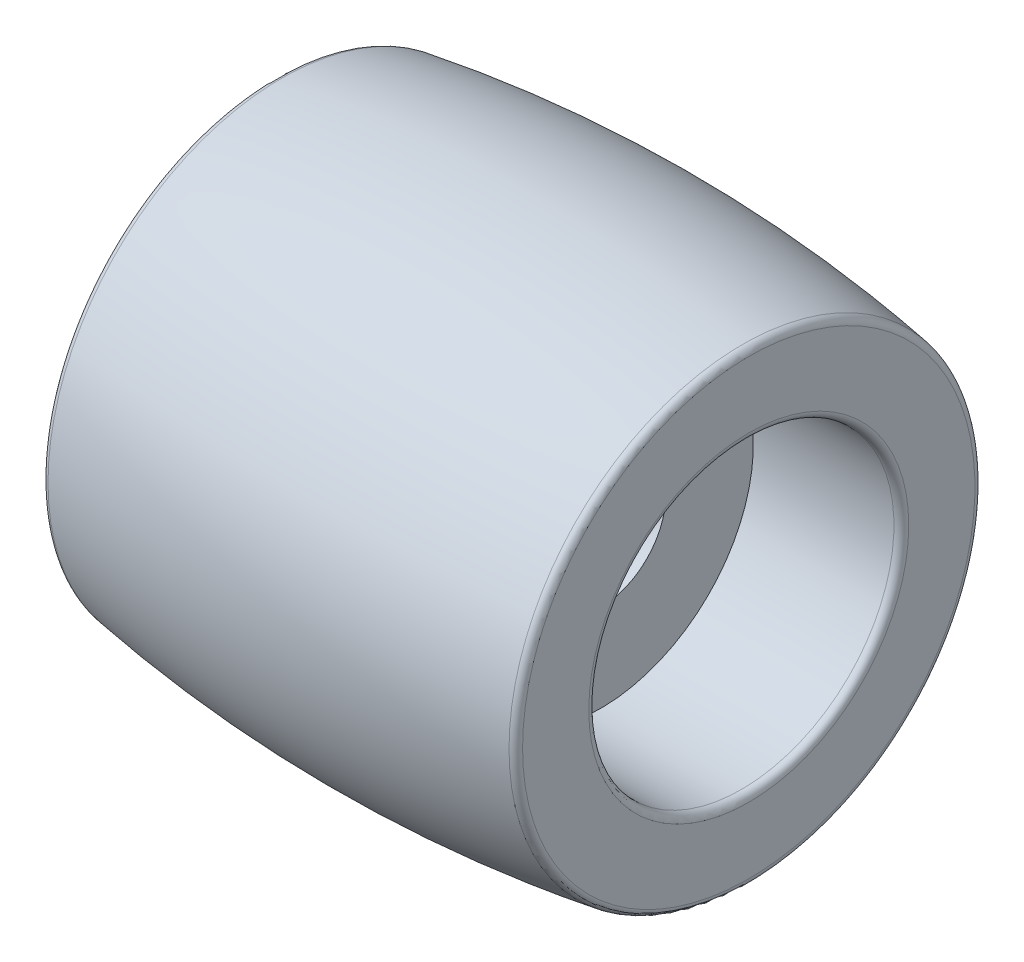
ISO-10303-21;
HEADER;
FILE_DESCRIPTION(('STEP AP214'),'2;1');
FILE_NAME('part.step','',(''),(''),'','','');
FILE_SCHEMA(('AUTOMOTIVE_DESIGN { 1 0 10303 214 1 1 1 1 }'));
ENDSEC;
DATA;
#1=APPLICATION_CONTEXT('core data for automotive mechanical design processes');
#2=APPLICATION_PROTOCOL_DEFINITION('international standard','automotive_design',2000,#1);
#3=PRODUCT_CONTEXT('',#1,'mechanical');
#4=PRODUCT('Part','Part','',(#3));
#5=PRODUCT_RELATED_PRODUCT_CATEGORY('part','',(#4));
#6=PRODUCT_DEFINITION_FORMATION('','',#4);
#7=PRODUCT_DEFINITION_CONTEXT('part definition',#1,'design');
#8=PRODUCT_DEFINITION('design','',#6,#7);
#9=PRODUCT_DEFINITION_SHAPE('','',#8);
#10=(LENGTH_UNIT() NAMED_UNIT(*) SI_UNIT(.MILLI.,.METRE.));
#11=(NAMED_UNIT(*) PLANE_ANGLE_UNIT() SI_UNIT($,.RADIAN.));
#12=(NAMED_UNIT(*) SI_UNIT($,.STERADIAN.) SOLID_ANGLE_UNIT());
#13=UNCERTAINTY_MEASURE_WITH_UNIT(LENGTH_MEASURE(1.E-05),#10,'distance_accuracy_value','');
#14=(GEOMETRIC_REPRESENTATION_CONTEXT(3) GLOBAL_UNCERTAINTY_ASSIGNED_CONTEXT((#13)) GLOBAL_UNIT_ASSIGNED_CONTEXT((#10,
#11,#12)) REPRESENTATION_CONTEXT('',''));
#15=CARTESIAN_POINT('',(0.,0.,0.));
#16=DIRECTION('',(0.,0.,1.));
#17=DIRECTION('',(1.,0.,0.));
#18=AXIS2_PLACEMENT_3D('',#15,#16,#17);
#19=CARTESIAN_POINT('',(0.,0.,0.));
#20=DIRECTION('',(-1.,0.,0.));
#21=DIRECTION('',(0.,0.,1.));
#22=AXIS2_PLACEMENT_3D('',#19,#20,#21);
#23=DEGENERATE_TOROIDAL_SURFACE('',#22,41.5,50.,.F.);
#24=CARTESIAN_POINT('',(-7.78894472361809,0.,0.));
#25=DIRECTION('',(1.,0.,0.));
#26=DIRECTION('',(0.,0.,-1.));
#27=AXIS2_PLACEMENT_3D('',#24,#25,#26);
#28=CIRCLE('',#27,7.88959748866579);
#29=CARTESIAN_POINT('',(-7.78894472361809,0.,-7.88959748866579));
#30=VERTEX_POINT('',#29);
#31=EDGE_CURVE('E61',#30,#30,#28,.T.);
#32=ORIENTED_EDGE('',*,*,#31,.T.);
#33=EDGE_LOOP('',(#32));
#34=FACE_BOUND('',#33,.T.);
#35=CARTESIAN_POINT('',(7.78894472361809,0.,0.));
#36=DIRECTION('',(-1.,0.,0.));
#37=DIRECTION('',(0.,0.,1.));
#38=AXIS2_PLACEMENT_3D('',#35,#36,#37);
#39=CIRCLE('',#38,7.88959748866579);
#40=CARTESIAN_POINT('',(7.78894472361809,0.,7.88959748866579));
#41=VERTEX_POINT('',#40);
#42=EDGE_CURVE('E65',#41,#41,#39,.T.);
#43=ORIENTED_EDGE('',*,*,#42,.T.);
#44=EDGE_LOOP('',(#43));
#45=FACE_BOUND('',#44,.T.);
#46=ADVANCED_FACE('F37',(#34,#45),#23,.F.);
#47=CARTESIAN_POINT('',(8.,5.15585071701227,0.));
#48=DIRECTION('',(-1.,0.,0.));
#49=DIRECTION('',(0.,0.,1.));
#50=AXIS2_PLACEMENT_3D('',#47,#48,#49);
#51=PLANE('',#50);
#52=CARTESIAN_POINT('',(8.,0.,0.));
#53=DIRECTION('',(-1.,0.,0.));
#54=DIRECTION('',(0.,0.,1.));
#55=AXIS2_PLACEMENT_3D('',#52,#53,#54);
#56=CIRCLE('',#55,5.40585071701227);
#57=CARTESIAN_POINT('',(8.,0.,5.40585071701227));
#58=VERTEX_POINT('',#57);
#59=EDGE_CURVE('E45',#58,#58,#56,.T.);
#60=ORIENTED_EDGE('',*,*,#59,.T.);
#61=EDGE_LOOP('',(#60));
#62=FACE_BOUND('',#61,.T.);
#63=CARTESIAN_POINT('',(8.,0.,0.));
#64=DIRECTION('',(-1.,0.,0.));
#65=DIRECTION('',(0.,0.,1.));
#66=AXIS2_PLACEMENT_3D('',#63,#64,#65);
#67=CIRCLE('',#66,7.64264950122246);
#68=CARTESIAN_POINT('',(8.,0.,7.64264950122246));
#69=VERTEX_POINT('',#68);
#70=EDGE_CURVE('E50',#69,#69,#67,.F.);
#71=ORIENTED_EDGE('',*,*,#70,.T.);
#72=EDGE_LOOP('',(#71));
#73=FACE_BOUND('',#72,.T.);
#74=ADVANCED_FACE('F112',(#62,#73),#51,.F.);
#75=CARTESIAN_POINT('',(-9.77367688022285,0.,0.));
#76=DIRECTION('',(-1.,0.,0.));
#77=DIRECTION('',(0.,0.,1.));
#78=AXIS2_PLACEMENT_3D('',#75,#76,#77);
#79=CYLINDRICAL_SURFACE('',#78,5.15585071701227);
#80=CARTESIAN_POINT('',(7.75,0.,0.));
#81=DIRECTION('',(-1.,0.,0.));
#82=DIRECTION('',(0.,0.,1.));
#83=AXIS2_PLACEMENT_3D('',#80,#81,#82);
#84=CIRCLE('',#83,5.15585071701227);
#85=CARTESIAN_POINT('',(7.75,0.,5.15585071701227));
#86=VERTEX_POINT('',#85);
#87=EDGE_CURVE('E10',#86,#86,#84,.F.);
#88=ORIENTED_EDGE('',*,*,#87,.T.);
#89=EDGE_LOOP('',(#88));
#90=FACE_BOUND('',#89,.T.);
#91=CARTESIAN_POINT('',(3.,0.,0.));
#92=DIRECTION('',(-1.,0.,0.));
#93=DIRECTION('',(0.,0.,1.));
#94=AXIS2_PLACEMENT_3D('',#91,#92,#93);
#95=CIRCLE('',#94,5.15585071701227);
#96=CARTESIAN_POINT('',(3.,0.,5.15585071701227));
#97=VERTEX_POINT('',#96);
#98=EDGE_CURVE('E77',#97,#97,#95,.T.);
#99=ORIENTED_EDGE('',*,*,#98,.T.);
#100=EDGE_LOOP('',(#99));
#101=FACE_BOUND('',#100,.T.);
#102=ADVANCED_FACE('F118',(#90,#101),#79,.F.);
#103=CARTESIAN_POINT('',(3.,2.2,0.));
#104=DIRECTION('',(-1.,0.,0.));
#105=DIRECTION('',(0.,0.,1.));
#106=AXIS2_PLACEMENT_3D('',#103,#104,#105);
#107=PLANE('',#106);
#108=ORIENTED_EDGE('',*,*,#98,.F.);
#109=EDGE_LOOP('',(#108));
#110=FACE_BOUND('',#109,.T.);
#111=CARTESIAN_POINT('',(3.,0.,0.));
#112=DIRECTION('',(-1.,0.,0.));
#113=DIRECTION('',(0.,0.,1.));
#114=AXIS2_PLACEMENT_3D('',#111,#112,#113);
#115=CIRCLE('',#114,2.2);
#116=CARTESIAN_POINT('',(3.,0.,2.2));
#117=VERTEX_POINT('',#116);
#118=EDGE_CURVE('E81',#117,#117,#115,.T.);
#119=ORIENTED_EDGE('',*,*,#118,.T.);
#120=EDGE_LOOP('',(#119));
#121=FACE_BOUND('',#120,.T.);
#122=ADVANCED_FACE('F179',(#110,#121),#107,.F.);
#123=CARTESIAN_POINT('',(-9.77367688022285,0.,0.));
#124=DIRECTION('',(-1.,0.,0.));
#125=DIRECTION('',(0.,0.,1.));
#126=AXIS2_PLACEMENT_3D('',#123,#124,#125);
#127=CYLINDRICAL_SURFACE('',#126,2.2);
#128=ORIENTED_EDGE('',*,*,#118,.F.);
#129=EDGE_LOOP('',(#128));
#130=FACE_BOUND('',#129,.T.);
#131=CARTESIAN_POINT('',(-3.,0.,0.));
#132=DIRECTION('',(-1.,0.,0.));
#133=DIRECTION('',(0.,0.,1.));
#134=AXIS2_PLACEMENT_3D('',#131,#132,#133);
#135=CIRCLE('',#134,2.2);
#136=CARTESIAN_POINT('',(-3.,0.,2.2));
#137=VERTEX_POINT('',#136);
#138=EDGE_CURVE('E85',#137,#137,#135,.T.);
#139=ORIENTED_EDGE('',*,*,#138,.T.);
#140=EDGE_LOOP('',(#139));
#141=FACE_BOUND('',#140,.T.);
#142=ADVANCED_FACE('F108',(#130,#141),#127,.F.);
#143=CARTESIAN_POINT('',(-3.,5.15585071701227,0.));
#144=DIRECTION('',(1.,0.,0.));
#145=DIRECTION('',(0.,0.,-1.));
#146=AXIS2_PLACEMENT_3D('',#143,#144,#145);
#147=PLANE('',#146);
#148=ORIENTED_EDGE('',*,*,#138,.F.);
#149=EDGE_LOOP('',(#148));
#150=FACE_BOUND('',#149,.T.);
#151=CARTESIAN_POINT('',(-3.,0.,0.));
#152=DIRECTION('',(-1.,0.,0.));
#153=DIRECTION('',(0.,0.,1.));
#154=AXIS2_PLACEMENT_3D('',#151,#152,#153);
#155=CIRCLE('',#154,5.15585071701227);
#156=CARTESIAN_POINT('',(-3.,0.,5.15585071701227));
#157=VERTEX_POINT('',#156);
#158=EDGE_CURVE('E89',#157,#157,#155,.T.);
#159=ORIENTED_EDGE('',*,*,#158,.T.);
#160=EDGE_LOOP('',(#159));
#161=FACE_BOUND('',#160,.T.);
#162=ADVANCED_FACE('F94',(#150,#161),#147,.F.);
#163=CARTESIAN_POINT('',(-9.77367688022285,0.,0.));
#164=DIRECTION('',(-1.,0.,0.));
#165=DIRECTION('',(0.,0.,1.));
#166=AXIS2_PLACEMENT_3D('',#163,#164,#165);
#167=CYLINDRICAL_SURFACE('',#166,5.15585071701227);
#168=CARTESIAN_POINT('',(-7.75,0.,0.));
#169=DIRECTION('',(1.,0.,0.));
#170=DIRECTION('',(0.,0.,-1.));
#171=AXIS2_PLACEMENT_3D('',#168,#169,#170);
#172=CIRCLE('',#171,5.15585071701227);
#173=CARTESIAN_POINT('',(-7.75,0.,-5.15585071701227));
#174=VERTEX_POINT('',#173);
#175=EDGE_CURVE('E55',#174,#174,#172,.F.);
#176=ORIENTED_EDGE('',*,*,#175,.T.);
#177=EDGE_LOOP('',(#176));
#178=FACE_BOUND('',#177,.T.);
#179=ORIENTED_EDGE('',*,*,#158,.F.);
#180=EDGE_LOOP('',(#179));
#181=FACE_BOUND('',#180,.T.);
#182=ADVANCED_FACE('F96',(#178,#181),#167,.F.);
#183=CARTESIAN_POINT('',(-8.,7.85585071701227,0.));
#184=DIRECTION('',(1.,0.,0.));
#185=DIRECTION('',(0.,0.,-1.));
#186=AXIS2_PLACEMENT_3D('',#183,#184,#185);
#187=PLANE('',#186);
#188=CARTESIAN_POINT('',(-8.,0.,0.));
#189=DIRECTION('',(1.,0.,0.));
#190=DIRECTION('',(0.,0.,-1.));
#191=AXIS2_PLACEMENT_3D('',#188,#189,#190);
#192=CIRCLE('',#191,7.64264950122246);
#193=CARTESIAN_POINT('',(-8.,0.,-7.64264950122246));
#194=VERTEX_POINT('',#193);
#195=EDGE_CURVE('E69',#194,#194,#192,.F.);
#196=ORIENTED_EDGE('',*,*,#195,.T.);
#197=EDGE_LOOP('',(#196));
#198=FACE_BOUND('',#197,.T.);
#199=CARTESIAN_POINT('',(-8.,0.,0.));
#200=DIRECTION('',(1.,0.,0.));
#201=DIRECTION('',(0.,0.,-1.));
#202=AXIS2_PLACEMENT_3D('',#199,#200,#201);
#203=CIRCLE('',#202,5.40585071701227);
#204=CARTESIAN_POINT('',(-8.,0.,-5.40585071701227));
#205=VERTEX_POINT('',#204);
#206=EDGE_CURVE('E73',#205,#205,#203,.T.);
#207=ORIENTED_EDGE('',*,*,#206,.T.);
#208=EDGE_LOOP('',(#207));
#209=FACE_BOUND('',#208,.T.);
#210=ADVANCED_FACE('F98',(#198,#209),#187,.F.);
#211=CARTESIAN_POINT('',(-7.75,0.,0.));
#212=DIRECTION('',(1.,0.,0.));
#213=DIRECTION('',(0.,0.,-1.));
#214=AXIS2_PLACEMENT_3D('',#211,#212,#213);
#215=TOROIDAL_SURFACE('',#214,7.64264950122246,0.25);
#216=ORIENTED_EDGE('',*,*,#31,.F.);
#217=EDGE_LOOP('',(#216));
#218=FACE_BOUND('',#217,.T.);
#219=ORIENTED_EDGE('',*,*,#195,.F.);
#220=EDGE_LOOP('',(#219));
#221=FACE_BOUND('',#220,.T.);
#222=ADVANCED_FACE('F105',(#218,#221),#215,.T.);
#223=CARTESIAN_POINT('',(-7.75,0.,0.));
#224=DIRECTION('',(1.,0.,0.));
#225=DIRECTION('',(0.,0.,-1.));
#226=AXIS2_PLACEMENT_3D('',#223,#224,#225);
#227=TOROIDAL_SURFACE('',#226,5.40585071701227,0.25);
#228=ORIENTED_EDGE('',*,*,#206,.F.);
#229=EDGE_LOOP('',(#228));
#230=FACE_BOUND('',#229,.T.);
#231=ORIENTED_EDGE('',*,*,#175,.F.);
#232=EDGE_LOOP('',(#231));
#233=FACE_BOUND('',#232,.T.);
#234=ADVANCED_FACE('F125',(#230,#233),#227,.T.);
#235=CARTESIAN_POINT('',(7.75,0.,0.));
#236=DIRECTION('',(-1.,0.,0.));
#237=DIRECTION('',(0.,0.,1.));
#238=AXIS2_PLACEMENT_3D('',#235,#236,#237);
#239=TOROIDAL_SURFACE('',#238,5.40585071701227,0.25);
#240=ORIENTED_EDGE('',*,*,#87,.F.);
#241=EDGE_LOOP('',(#240));
#242=FACE_BOUND('',#241,.T.);
#243=ORIENTED_EDGE('',*,*,#59,.F.);
#244=EDGE_LOOP('',(#243));
#245=FACE_BOUND('',#244,.T.);
#246=ADVANCED_FACE('F128',(#242,#245),#239,.T.);
#247=CARTESIAN_POINT('',(7.75,0.,0.));
#248=DIRECTION('',(-1.,0.,0.));
#249=DIRECTION('',(0.,0.,1.));
#250=AXIS2_PLACEMENT_3D('',#247,#248,#249);
#251=TOROIDAL_SURFACE('',#250,7.64264950122246,0.25);
#252=ORIENTED_EDGE('',*,*,#70,.F.);
#253=EDGE_LOOP('',(#252));
#254=FACE_BOUND('',#253,.T.);
#255=ORIENTED_EDGE('',*,*,#42,.F.);
#256=EDGE_LOOP('',(#255));
#257=FACE_BOUND('',#256,.T.);
#258=ADVANCED_FACE('F39',(#254,#257),#251,.T.);
#259=CLOSED_SHELL('',(#46,#74,#102,#122,#142,#162,#182,#210,#222,#234,#246,#258));
#260=MANIFOLD_SOLID_BREP('B2',#259);
#261=ADVANCED_BREP_SHAPE_REPRESENTATION('',(#18,#260),#14);
#262=SHAPE_DEFINITION_REPRESENTATION(#9,#261);
ENDSEC;
END-ISO-10303-21;
